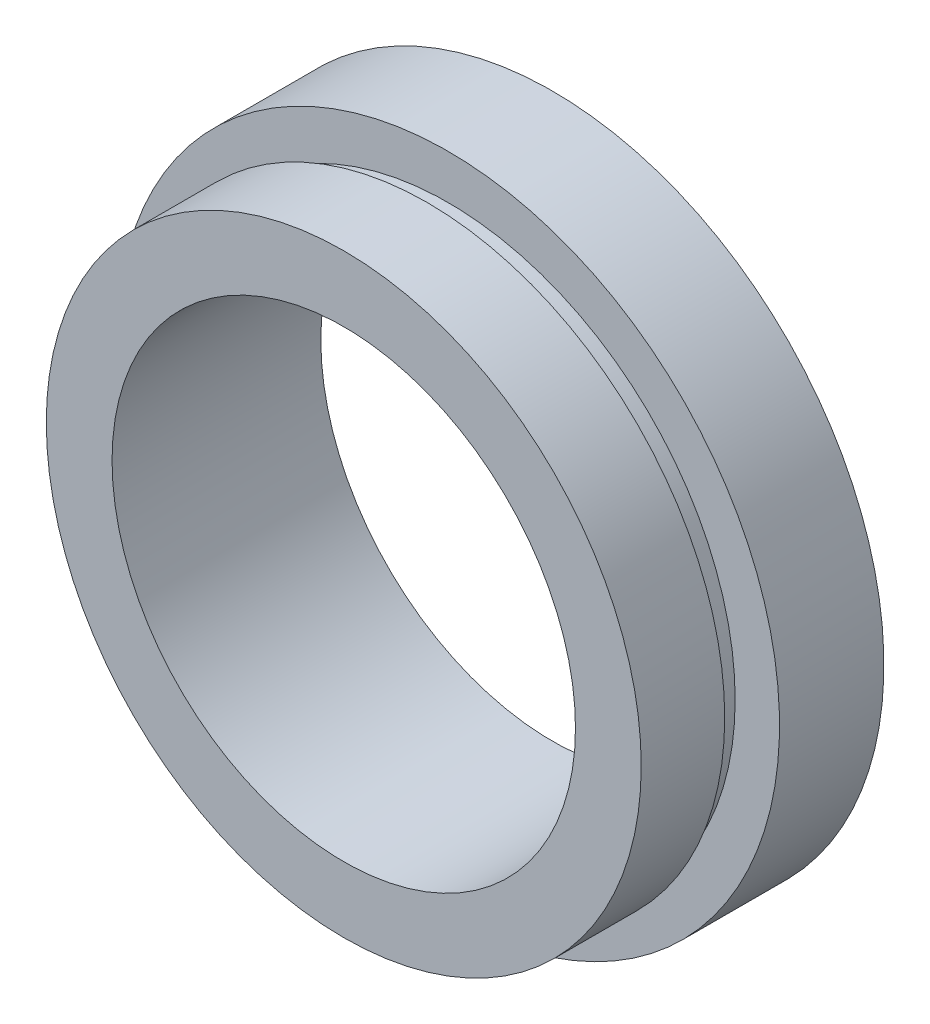
ISO-10303-21;
HEADER;
FILE_DESCRIPTION(('STEP AP214'),'2;1');
FILE_NAME('part.step','',(''),(''),'','','');
FILE_SCHEMA(('AUTOMOTIVE_DESIGN { 1 0 10303 214 1 1 1 1 }'));
ENDSEC;
DATA;
#1=APPLICATION_CONTEXT('core data for automotive mechanical design processes');
#2=APPLICATION_PROTOCOL_DEFINITION('international standard','automotive_design',2000,#1);
#3=PRODUCT_CONTEXT('',#1,'mechanical');
#4=PRODUCT('Part','Part','',(#3));
#5=PRODUCT_RELATED_PRODUCT_CATEGORY('part','',(#4));
#6=PRODUCT_DEFINITION_FORMATION('','',#4);
#7=PRODUCT_DEFINITION_CONTEXT('part definition',#1,'design');
#8=PRODUCT_DEFINITION('design','',#6,#7);
#9=PRODUCT_DEFINITION_SHAPE('','',#8);
#10=(LENGTH_UNIT() NAMED_UNIT(*) SI_UNIT(.MILLI.,.METRE.));
#11=(NAMED_UNIT(*) PLANE_ANGLE_UNIT() SI_UNIT($,.RADIAN.));
#12=(NAMED_UNIT(*) SI_UNIT($,.STERADIAN.) SOLID_ANGLE_UNIT());
#13=UNCERTAINTY_MEASURE_WITH_UNIT(LENGTH_MEASURE(1.E-05),#10,'distance_accuracy_value','');
#14=(GEOMETRIC_REPRESENTATION_CONTEXT(3) GLOBAL_UNCERTAINTY_ASSIGNED_CONTEXT((#13)) GLOBAL_UNIT_ASSIGNED_CONTEXT((#10,
#11,#12)) REPRESENTATION_CONTEXT('',''));
#15=CARTESIAN_POINT('',(0.,0.,0.));
#16=DIRECTION('',(0.,0.,1.));
#17=DIRECTION('',(1.,0.,0.));
#18=AXIS2_PLACEMENT_3D('',#15,#16,#17);
#19=CARTESIAN_POINT('',(11.1,0.,0.));
#20=DIRECTION('',(0.,0.,-1.));
#21=DIRECTION('',(-1.,0.,0.));
#22=AXIS2_PLACEMENT_3D('',#19,#20,#21);
#23=PLANE('',#22);
#24=CARTESIAN_POINT('',(0.,0.,0.));
#25=DIRECTION('',(0.,0.,-1.));
#26=DIRECTION('',(-1.,0.,0.));
#27=AXIS2_PLACEMENT_3D('',#24,#25,#26);
#28=CIRCLE('',#27,14.25);
#29=CARTESIAN_POINT('',(-14.25,0.,0.));
#30=VERTEX_POINT('',#29);
#31=EDGE_CURVE('E10',#30,#30,#28,.T.);
#32=ORIENTED_EDGE('',*,*,#31,.F.);
#33=EDGE_LOOP('',(#32));
#34=FACE_BOUND('',#33,.T.);
#35=CARTESIAN_POINT('',(0.,0.,0.));
#36=DIRECTION('',(0.,0.,-1.));
#37=DIRECTION('',(-1.,0.,0.));
#38=AXIS2_PLACEMENT_3D('',#35,#36,#37);
#39=CIRCLE('',#38,11.1);
#40=CARTESIAN_POINT('',(-11.1,0.,0.));
#41=VERTEX_POINT('',#40);
#42=EDGE_CURVE('E61',#41,#41,#39,.T.);
#43=ORIENTED_EDGE('',*,*,#42,.T.);
#44=EDGE_LOOP('',(#43));
#45=FACE_BOUND('',#44,.T.);
#46=ADVANCED_FACE('F33',(#34,#45),#23,.F.);
#47=CARTESIAN_POINT('',(0.,0.,-19.1405797101449));
#48=DIRECTION('',(0.,0.,-1.));
#49=DIRECTION('',(-1.,0.,0.));
#50=AXIS2_PLACEMENT_3D('',#47,#48,#49);
#51=CYLINDRICAL_SURFACE('',#50,14.25);
#52=CARTESIAN_POINT('',(0.,0.,-4.));
#53=DIRECTION('',(0.,0.,-1.));
#54=DIRECTION('',(-1.,0.,0.));
#55=AXIS2_PLACEMENT_3D('',#52,#53,#54);
#56=CIRCLE('',#55,14.25);
#57=CARTESIAN_POINT('',(-14.25,0.,-4.));
#58=VERTEX_POINT('',#57);
#59=EDGE_CURVE('E39',#58,#58,#56,.T.);
#60=ORIENTED_EDGE('',*,*,#59,.F.);
#61=EDGE_LOOP('',(#60));
#62=FACE_BOUND('',#61,.T.);
#63=ORIENTED_EDGE('',*,*,#31,.T.);
#64=EDGE_LOOP('',(#63));
#65=FACE_BOUND('',#64,.T.);
#66=ADVANCED_FACE('F98',(#62,#65),#51,.T.);
#67=CARTESIAN_POINT('',(14.25,0.,-4.));
#68=DIRECTION('',(0.,0.,1.));
#69=DIRECTION('',(1.,0.,0.));
#70=AXIS2_PLACEMENT_3D('',#67,#68,#69);
#71=PLANE('',#70);
#72=CARTESIAN_POINT('',(0.,0.,-4.));
#73=DIRECTION('',(0.,0.,-1.));
#74=DIRECTION('',(-1.,0.,0.));
#75=AXIS2_PLACEMENT_3D('',#72,#73,#74);
#76=CIRCLE('',#75,13.75);
#77=CARTESIAN_POINT('',(-13.75,0.,-4.));
#78=VERTEX_POINT('',#77);
#79=EDGE_CURVE('E43',#78,#78,#76,.T.);
#80=ORIENTED_EDGE('',*,*,#79,.F.);
#81=EDGE_LOOP('',(#80));
#82=FACE_BOUND('',#81,.T.);
#83=ORIENTED_EDGE('',*,*,#59,.T.);
#84=EDGE_LOOP('',(#83));
#85=FACE_BOUND('',#84,.T.);
#86=ADVANCED_FACE('F93',(#82,#85),#71,.F.);
#87=CARTESIAN_POINT('',(0.,0.,-19.1405797101449));
#88=DIRECTION('',(0.,0.,-1.));
#89=DIRECTION('',(-1.,0.,0.));
#90=AXIS2_PLACEMENT_3D('',#87,#88,#89);
#91=CYLINDRICAL_SURFACE('',#90,13.75);
#92=CARTESIAN_POINT('',(0.,0.,-5.));
#93=DIRECTION('',(0.,0.,-1.));
#94=DIRECTION('',(-1.,0.,0.));
#95=AXIS2_PLACEMENT_3D('',#92,#93,#94);
#96=CIRCLE('',#95,13.75);
#97=CARTESIAN_POINT('',(-13.75,0.,-5.));
#98=VERTEX_POINT('',#97);
#99=EDGE_CURVE('E47',#98,#98,#96,.T.);
#100=ORIENTED_EDGE('',*,*,#99,.F.);
#101=EDGE_LOOP('',(#100));
#102=FACE_BOUND('',#101,.T.);
#103=ORIENTED_EDGE('',*,*,#79,.T.);
#104=EDGE_LOOP('',(#103));
#105=FACE_BOUND('',#104,.T.);
#106=ADVANCED_FACE('F87',(#102,#105),#91,.T.);
#107=CARTESIAN_POINT('',(13.75,0.,-5.));
#108=DIRECTION('',(0.,0.,-1.));
#109=DIRECTION('',(-1.,0.,0.));
#110=AXIS2_PLACEMENT_3D('',#107,#108,#109);
#111=PLANE('',#110);
#112=CARTESIAN_POINT('',(0.,0.,-5.));
#113=DIRECTION('',(0.,0.,-1.));
#114=DIRECTION('',(-1.,0.,0.));
#115=AXIS2_PLACEMENT_3D('',#112,#113,#114);
#116=CIRCLE('',#115,15.875);
#117=CARTESIAN_POINT('',(-15.875,0.,-5.));
#118=VERTEX_POINT('',#117);
#119=EDGE_CURVE('E52',#118,#118,#116,.T.);
#120=ORIENTED_EDGE('',*,*,#119,.F.);
#121=EDGE_LOOP('',(#120));
#122=FACE_BOUND('',#121,.T.);
#123=ORIENTED_EDGE('',*,*,#99,.T.);
#124=EDGE_LOOP('',(#123));
#125=FACE_BOUND('',#124,.T.);
#126=ADVANCED_FACE('F81',(#122,#125),#111,.F.);
#127=CARTESIAN_POINT('',(0.,0.,-19.1405797101449));
#128=DIRECTION('',(0.,0.,-1.));
#129=DIRECTION('',(-1.,0.,0.));
#130=AXIS2_PLACEMENT_3D('',#127,#128,#129);
#131=CYLINDRICAL_SURFACE('',#130,15.875);
#132=CARTESIAN_POINT('',(0.,0.,-10.));
#133=DIRECTION('',(0.,0.,-1.));
#134=DIRECTION('',(-1.,0.,0.));
#135=AXIS2_PLACEMENT_3D('',#132,#133,#134);
#136=CIRCLE('',#135,15.875);
#137=CARTESIAN_POINT('',(-15.875,0.,-10.));
#138=VERTEX_POINT('',#137);
#139=EDGE_CURVE('E55',#138,#138,#136,.T.);
#140=ORIENTED_EDGE('',*,*,#139,.F.);
#141=EDGE_LOOP('',(#140));
#142=FACE_BOUND('',#141,.T.);
#143=ORIENTED_EDGE('',*,*,#119,.T.);
#144=EDGE_LOOP('',(#143));
#145=FACE_BOUND('',#144,.T.);
#146=ADVANCED_FACE('F75',(#142,#145),#131,.T.);
#147=CARTESIAN_POINT('',(15.875,0.,-10.));
#148=DIRECTION('',(0.,0.,1.));
#149=DIRECTION('',(1.,0.,0.));
#150=AXIS2_PLACEMENT_3D('',#147,#148,#149);
#151=PLANE('',#150);
#152=CARTESIAN_POINT('',(0.,0.,-10.));
#153=DIRECTION('',(0.,0.,-1.));
#154=DIRECTION('',(-1.,0.,0.));
#155=AXIS2_PLACEMENT_3D('',#152,#153,#154);
#156=CIRCLE('',#155,11.1);
#157=CARTESIAN_POINT('',(-11.1,0.,-10.));
#158=VERTEX_POINT('',#157);
#159=EDGE_CURVE('E58',#158,#158,#156,.T.);
#160=ORIENTED_EDGE('',*,*,#159,.F.);
#161=EDGE_LOOP('',(#160));
#162=FACE_BOUND('',#161,.T.);
#163=ORIENTED_EDGE('',*,*,#139,.T.);
#164=EDGE_LOOP('',(#163));
#165=FACE_BOUND('',#164,.T.);
#166=ADVANCED_FACE('F69',(#162,#165),#151,.F.);
#167=CARTESIAN_POINT('',(0.,0.,-19.1405797101449));
#168=DIRECTION('',(0.,0.,-1.));
#169=DIRECTION('',(-1.,0.,0.));
#170=AXIS2_PLACEMENT_3D('',#167,#168,#169);
#171=CYLINDRICAL_SURFACE('',#170,11.1);
#172=ORIENTED_EDGE('',*,*,#42,.F.);
#173=EDGE_LOOP('',(#172));
#174=FACE_BOUND('',#173,.T.);
#175=ORIENTED_EDGE('',*,*,#159,.T.);
#176=EDGE_LOOP('',(#175));
#177=FACE_BOUND('',#176,.T.);
#178=ADVANCED_FACE('F66',(#174,#177),#171,.F.);
#179=CLOSED_SHELL('',(#46,#66,#86,#106,#126,#146,#166,#178));
#180=MANIFOLD_SOLID_BREP('B2',#179);
#181=ADVANCED_BREP_SHAPE_REPRESENTATION('',(#18,#180),#14);
#182=SHAPE_DEFINITION_REPRESENTATION(#9,#181);
ENDSEC;
END-ISO-10303-21;
